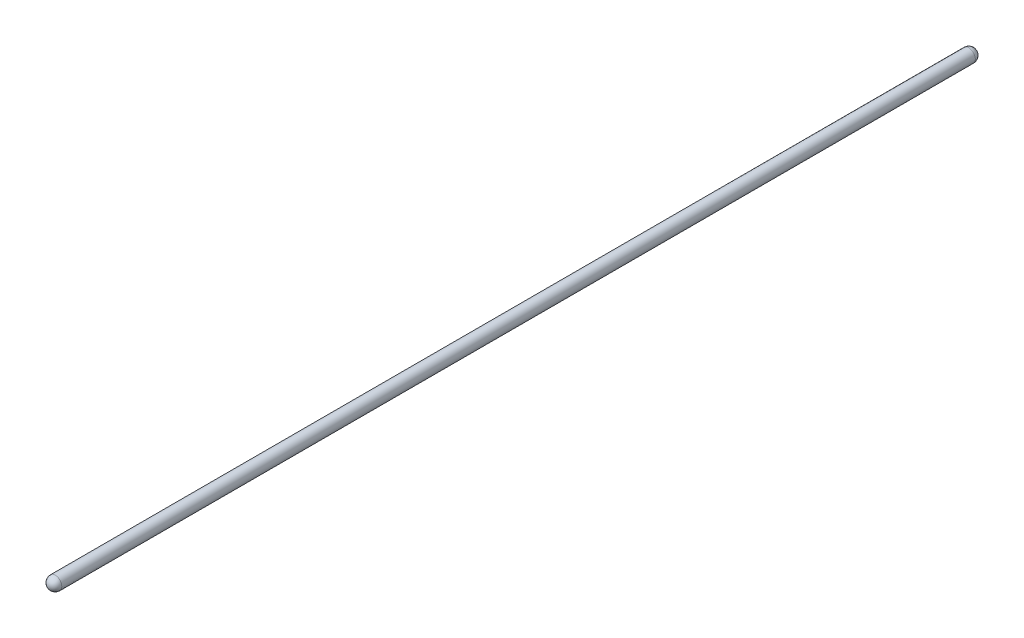
ISO-10303-21;
HEADER;
FILE_DESCRIPTION(('STEP AP214'),'2;1');
FILE_NAME('part.step','',(''),(''),'','','');
FILE_SCHEMA(('AUTOMOTIVE_DESIGN { 1 0 10303 214 1 1 1 1 }'));
ENDSEC;
DATA;
#1=APPLICATION_CONTEXT('core data for automotive mechanical design processes');
#2=APPLICATION_PROTOCOL_DEFINITION('international standard','automotive_design',2000,#1);
#3=PRODUCT_CONTEXT('',#1,'mechanical');
#4=PRODUCT('Part','Part','',(#3));
#5=PRODUCT_RELATED_PRODUCT_CATEGORY('part','',(#4));
#6=PRODUCT_DEFINITION_FORMATION('','',#4);
#7=PRODUCT_DEFINITION_CONTEXT('part definition',#1,'design');
#8=PRODUCT_DEFINITION('design','',#6,#7);
#9=PRODUCT_DEFINITION_SHAPE('','',#8);
#10=(LENGTH_UNIT() NAMED_UNIT(*) SI_UNIT(.MILLI.,.METRE.));
#11=(NAMED_UNIT(*) PLANE_ANGLE_UNIT() SI_UNIT($,.RADIAN.));
#12=(NAMED_UNIT(*) SI_UNIT($,.STERADIAN.) SOLID_ANGLE_UNIT());
#13=UNCERTAINTY_MEASURE_WITH_UNIT(LENGTH_MEASURE(1.E-05),#10,'distance_accuracy_value','');
#14=(GEOMETRIC_REPRESENTATION_CONTEXT(3) GLOBAL_UNCERTAINTY_ASSIGNED_CONTEXT((#13)) GLOBAL_UNIT_ASSIGNED_CONTEXT((#10,
#11,#12)) REPRESENTATION_CONTEXT('',''));
#15=CARTESIAN_POINT('',(0.,0.,0.));
#16=DIRECTION('',(0.,0.,1.));
#17=DIRECTION('',(1.,0.,0.));
#18=AXIS2_PLACEMENT_3D('',#15,#16,#17);
#19=CARTESIAN_POINT('',(0.,0.,0.));
#20=DIRECTION('',(0.,0.,-1.));
#21=DIRECTION('',(1.,0.,0.));
#22=AXIS2_PLACEMENT_3D('',#19,#20,#21);
#23=SPHERICAL_SURFACE('',#22,9.525);
#24=CARTESIAN_POINT('',(0.,0.,0.));
#25=DIRECTION('',(0.,0.,-1.));
#26=DIRECTION('',(-1.,0.,0.));
#27=AXIS2_PLACEMENT_3D('',#24,#25,#26);
#28=CIRCLE('',#27,9.525);
#29=CARTESIAN_POINT('',(-9.525,0.,0.));
#30=VERTEX_POINT('',#29);
#31=EDGE_CURVE('E10',#30,#30,#28,.T.);
#32=ORIENTED_EDGE('',*,*,#31,.T.);
#33=EDGE_LOOP('',(#32));
#34=FACE_BOUND('',#33,.T.);
#35=ADVANCED_FACE('F31',(#34),#23,.T.);
#36=CARTESIAN_POINT('',(0.,0.,-9.525));
#37=DIRECTION('',(0.,0.,-1.));
#38=DIRECTION('',(-1.,0.,0.));
#39=AXIS2_PLACEMENT_3D('',#36,#37,#38);
#40=CYLINDRICAL_SURFACE('',#39,9.52500000000001);
#41=ORIENTED_EDGE('',*,*,#31,.F.);
#42=EDGE_LOOP('',(#41));
#43=FACE_BOUND('',#42,.T.);
#44=CARTESIAN_POINT('',(1.63771374735053E-13,0.,1327.76976));
#45=DIRECTION('',(0.,0.,-1.));
#46=DIRECTION('',(-1.,0.,0.));
#47=AXIS2_PLACEMENT_3D('',#44,#45,#46);
#48=CIRCLE('',#47,9.52500000000003);
#49=CARTESIAN_POINT('',(-9.52499999999987,0.,1327.76976));
#50=VERTEX_POINT('',#49);
#51=EDGE_CURVE('E37',#50,#50,#48,.T.);
#52=ORIENTED_EDGE('',*,*,#51,.T.);
#53=EDGE_LOOP('',(#52));
#54=FACE_BOUND('',#53,.T.);
#55=ADVANCED_FACE('F43',(#43,#54),#40,.T.);
#56=CARTESIAN_POINT('',(0.,0.,1327.76976));
#57=DIRECTION('',(0.,0.,-1.));
#58=DIRECTION('',(1.,0.,0.));
#59=AXIS2_PLACEMENT_3D('',#56,#57,#58);
#60=SPHERICAL_SURFACE('',#59,9.5250000000002);
#61=ORIENTED_EDGE('',*,*,#51,.F.);
#62=EDGE_LOOP('',(#61));
#63=FACE_BOUND('',#62,.T.);
#64=ADVANCED_FACE('F45',(#63),#60,.T.);
#65=CLOSED_SHELL('',(#35,#55,#64));
#66=MANIFOLD_SOLID_BREP('B2',#65);
#67=ADVANCED_BREP_SHAPE_REPRESENTATION('',(#18,#66),#14);
#68=SHAPE_DEFINITION_REPRESENTATION(#9,#67);
ENDSEC;
END-ISO-10303-21;
